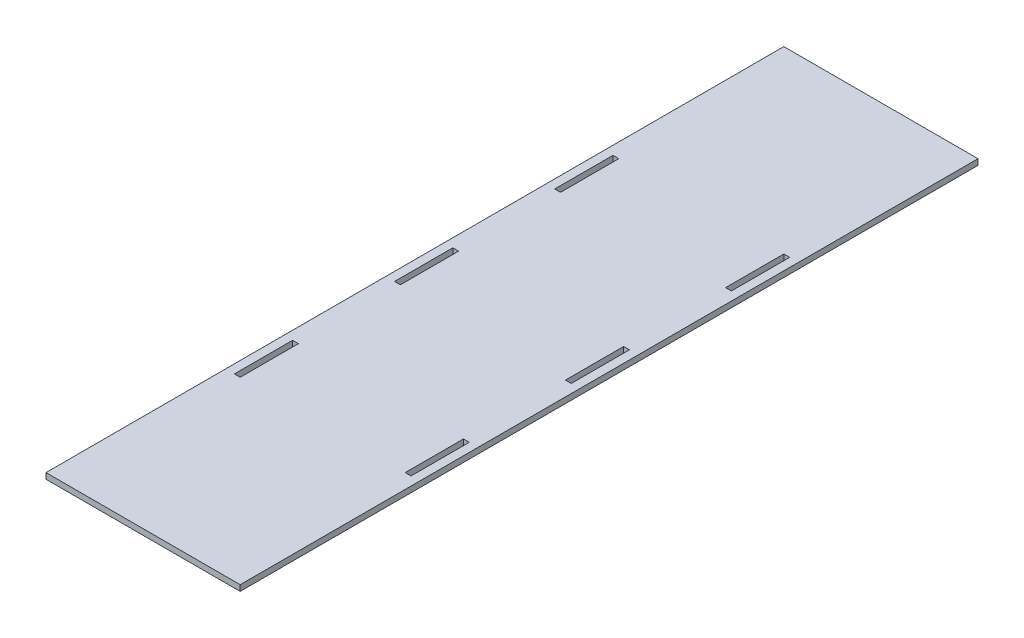
ISO-10303-21;
HEADER;
FILE_DESCRIPTION(('STEP AP214'),'2;1');
FILE_NAME('part.step','',(''),(''),'','','');
FILE_SCHEMA(('AUTOMOTIVE_DESIGN { 1 0 10303 214 1 1 1 1 }'));
ENDSEC;
DATA;
#1=APPLICATION_CONTEXT('core data for automotive mechanical design processes');
#2=APPLICATION_PROTOCOL_DEFINITION('international standard','automotive_design',2000,#1);
#3=PRODUCT_CONTEXT('',#1,'mechanical');
#4=PRODUCT('Part','Part','',(#3));
#5=PRODUCT_RELATED_PRODUCT_CATEGORY('part','',(#4));
#6=PRODUCT_DEFINITION_FORMATION('','',#4);
#7=PRODUCT_DEFINITION_CONTEXT('part definition',#1,'design');
#8=PRODUCT_DEFINITION('design','',#6,#7);
#9=PRODUCT_DEFINITION_SHAPE('','',#8);
#10=(LENGTH_UNIT() NAMED_UNIT(*) SI_UNIT(.MILLI.,.METRE.));
#11=(NAMED_UNIT(*) PLANE_ANGLE_UNIT() SI_UNIT($,.RADIAN.));
#12=(NAMED_UNIT(*) SI_UNIT($,.STERADIAN.) SOLID_ANGLE_UNIT());
#13=UNCERTAINTY_MEASURE_WITH_UNIT(LENGTH_MEASURE(1.E-05),#10,'distance_accuracy_value','');
#14=(GEOMETRIC_REPRESENTATION_CONTEXT(3) GLOBAL_UNCERTAINTY_ASSIGNED_CONTEXT((#13)) GLOBAL_UNIT_ASSIGNED_CONTEXT((#10,
#11,#12)) REPRESENTATION_CONTEXT('',''));
#15=CARTESIAN_POINT('',(0.,0.,0.));
#16=DIRECTION('',(0.,0.,1.));
#17=DIRECTION('',(1.,0.,0.));
#18=AXIS2_PLACEMENT_3D('',#15,#16,#17);
#19=CARTESIAN_POINT('',(0.,3.,0.));
#20=DIRECTION('',(0.,-1.,0.));
#21=DIRECTION('',(0.,0.,-1.));
#22=AXIS2_PLACEMENT_3D('',#19,#20,#21);
#23=PLANE('',#22);
#24=DIRECTION('',(0.,0.,-1.));
#25=VECTOR('',#24,1.);
#26=CARTESIAN_POINT('',(45.5,3.,-15.));
#27=LINE('',#26,#25);
#28=CARTESIAN_POINT('',(45.5,3.,15.));
#29=VERTEX_POINT('',#28);
#30=CARTESIAN_POINT('',(45.5,3.,-15.));
#31=VERTEX_POINT('',#30);
#32=EDGE_CURVE('E259',#29,#31,#27,.T.);
#33=ORIENTED_EDGE('',*,*,#32,.F.);
#34=DIRECTION('',(1.,0.,0.));
#35=VECTOR('',#34,1.);
#36=CARTESIAN_POINT('',(42.5,3.,15.));
#37=LINE('',#36,#35);
#38=CARTESIAN_POINT('',(42.5,3.,15.));
#39=VERTEX_POINT('',#38);
#40=EDGE_CURVE('E267',#39,#29,#37,.T.);
#41=ORIENTED_EDGE('',*,*,#40,.F.);
#42=DIRECTION('',(0.,0.,1.));
#43=VECTOR('',#42,1.);
#44=CARTESIAN_POINT('',(42.5,3.,-15.));
#45=LINE('',#44,#43);
#46=CARTESIAN_POINT('',(42.5,3.,-15.));
#47=VERTEX_POINT('',#46);
#48=EDGE_CURVE('E264',#47,#39,#45,.T.);
#49=ORIENTED_EDGE('',*,*,#48,.F.);
#50=DIRECTION('',(-1.,0.,0.));
#51=VECTOR('',#50,1.);
#52=CARTESIAN_POINT('',(42.5,3.,-15.));
#53=LINE('',#52,#51);
#54=EDGE_CURVE('E261',#31,#47,#53,.T.);
#55=ORIENTED_EDGE('',*,*,#54,.F.);
#56=EDGE_LOOP('',(#33,#41,#49,#55));
#57=FACE_BOUND('',#56,.T.);
#58=DIRECTION('',(0.,0.,-1.));
#59=VECTOR('',#58,1.);
#60=CARTESIAN_POINT('',(-42.5,3.,67.5));
#61=LINE('',#60,#59);
#62=CARTESIAN_POINT('',(-42.5,3.,97.5));
#63=VERTEX_POINT('',#62);
#64=CARTESIAN_POINT('',(-42.5,3.,67.5));
#65=VERTEX_POINT('',#64);
#66=EDGE_CURVE('E321',#63,#65,#61,.T.);
#67=ORIENTED_EDGE('',*,*,#66,.F.);
#68=DIRECTION('',(1.,0.,0.));
#69=VECTOR('',#68,1.);
#70=CARTESIAN_POINT('',(-45.5,3.,97.5));
#71=LINE('',#70,#69);
#72=CARTESIAN_POINT('',(-45.5,3.,97.5));
#73=VERTEX_POINT('',#72);
#74=EDGE_CURVE('E329',#73,#63,#71,.T.);
#75=ORIENTED_EDGE('',*,*,#74,.F.);
#76=DIRECTION('',(0.,0.,1.));
#77=VECTOR('',#76,1.);
#78=CARTESIAN_POINT('',(-45.5,3.,67.5));
#79=LINE('',#78,#77);
#80=CARTESIAN_POINT('',(-45.5,3.,67.5));
#81=VERTEX_POINT('',#80);
#82=EDGE_CURVE('E326',#81,#73,#79,.T.);
#83=ORIENTED_EDGE('',*,*,#82,.F.);
#84=DIRECTION('',(-1.,0.,0.));
#85=VECTOR('',#84,1.);
#86=CARTESIAN_POINT('',(-45.5,3.,67.5));
#87=LINE('',#86,#85);
#88=EDGE_CURVE('E323',#65,#81,#87,.T.);
#89=ORIENTED_EDGE('',*,*,#88,.F.);
#90=EDGE_LOOP('',(#67,#75,#83,#89));
#91=FACE_BOUND('',#90,.T.);
#92=DIRECTION('',(0.,0.,-1.));
#93=VECTOR('',#92,1.);
#94=CARTESIAN_POINT('',(-42.5,3.,-97.4999999999999));
#95=LINE('',#94,#93);
#96=CARTESIAN_POINT('',(-42.5,3.,-67.4999999999999));
#97=VERTEX_POINT('',#96);
#98=CARTESIAN_POINT('',(-42.5,3.,-97.4999999999999));
#99=VERTEX_POINT('',#98);
#100=EDGE_CURVE('E383',#97,#99,#95,.T.);
#101=ORIENTED_EDGE('',*,*,#100,.F.);
#102=DIRECTION('',(1.,0.,0.));
#103=VECTOR('',#102,1.);
#104=CARTESIAN_POINT('',(-45.5,3.,-67.4999999999999));
#105=LINE('',#104,#103);
#106=CARTESIAN_POINT('',(-45.5,3.,-67.4999999999999));
#107=VERTEX_POINT('',#106);
#108=EDGE_CURVE('E391',#107,#97,#105,.T.);
#109=ORIENTED_EDGE('',*,*,#108,.F.);
#110=DIRECTION('',(0.,0.,1.));
#111=VECTOR('',#110,1.);
#112=CARTESIAN_POINT('',(-45.5,3.,-97.4999999999999));
#113=LINE('',#112,#111);
#114=CARTESIAN_POINT('',(-45.5,3.,-97.4999999999999));
#115=VERTEX_POINT('',#114);
#116=EDGE_CURVE('E388',#115,#107,#113,.T.);
#117=ORIENTED_EDGE('',*,*,#116,.F.);
#118=DIRECTION('',(-1.,0.,0.));
#119=VECTOR('',#118,1.);
#120=CARTESIAN_POINT('',(-45.5,3.,-97.4999999999999));
#121=LINE('',#120,#119);
#122=EDGE_CURVE('E385',#99,#115,#121,.T.);
#123=ORIENTED_EDGE('',*,*,#122,.F.);
#124=EDGE_LOOP('',(#101,#109,#117,#123));
#125=FACE_BOUND('',#124,.T.);
#126=DIRECTION('',(0.,0.,-1.));
#127=VECTOR('',#126,1.);
#128=CARTESIAN_POINT('',(50.,3.,190.));
#129=LINE('',#128,#127);
#130=CARTESIAN_POINT('',(50.,3.,190.));
#131=VERTEX_POINT('',#130);
#132=CARTESIAN_POINT('',(50.,3.,-190.));
#133=VERTEX_POINT('',#132);
#134=EDGE_CURVE('E414',#131,#133,#129,.T.);
#135=ORIENTED_EDGE('',*,*,#134,.T.);
#136=DIRECTION('',(-1.,0.,0.));
#137=VECTOR('',#136,1.);
#138=CARTESIAN_POINT('',(-50.,3.,-190.));
#139=LINE('',#138,#137);
#140=CARTESIAN_POINT('',(-50.,3.,-190.));
#141=VERTEX_POINT('',#140);
#142=EDGE_CURVE('E417',#133,#141,#139,.T.);
#143=ORIENTED_EDGE('',*,*,#142,.T.);
#144=DIRECTION('',(0.,0.,1.));
#145=VECTOR('',#144,1.);
#146=CARTESIAN_POINT('',(-50.,3.,190.));
#147=LINE('',#146,#145);
#148=CARTESIAN_POINT('',(-50.,3.,190.));
#149=VERTEX_POINT('',#148);
#150=EDGE_CURVE('E420',#141,#149,#147,.T.);
#151=ORIENTED_EDGE('',*,*,#150,.T.);
#152=DIRECTION('',(1.,0.,0.));
#153=VECTOR('',#152,1.);
#154=CARTESIAN_POINT('',(-50.,3.,190.));
#155=LINE('',#154,#153);
#156=EDGE_CURVE('E422',#149,#131,#155,.T.);
#157=ORIENTED_EDGE('',*,*,#156,.T.);
#158=EDGE_LOOP('',(#135,#143,#151,#157));
#159=FACE_BOUND('',#158,.T.);
#160=DIRECTION('',(0.,0.,-1.));
#161=VECTOR('',#160,1.);
#162=CARTESIAN_POINT('',(-42.5000000000001,3.,-15.));
#163=LINE('',#162,#161);
#164=CARTESIAN_POINT('',(-42.5000000000001,3.,15.));
#165=VERTEX_POINT('',#164);
#166=CARTESIAN_POINT('',(-42.5000000000001,3.,-15.));
#167=VERTEX_POINT('',#166);
#168=EDGE_CURVE('E352',#165,#167,#163,.T.);
#169=ORIENTED_EDGE('',*,*,#168,.F.);
#170=DIRECTION('',(1.,0.,0.));
#171=VECTOR('',#170,1.);
#172=CARTESIAN_POINT('',(-45.5000000000001,3.,15.));
#173=LINE('',#172,#171);
#174=CARTESIAN_POINT('',(-45.5000000000001,3.,15.));
#175=VERTEX_POINT('',#174);
#176=EDGE_CURVE('E360',#175,#165,#173,.T.);
#177=ORIENTED_EDGE('',*,*,#176,.F.);
#178=DIRECTION('',(0.,0.,1.));
#179=VECTOR('',#178,1.);
#180=CARTESIAN_POINT('',(-45.5000000000001,3.,-15.));
#181=LINE('',#180,#179);
#182=CARTESIAN_POINT('',(-45.5000000000001,3.,-15.));
#183=VERTEX_POINT('',#182);
#184=EDGE_CURVE('E357',#183,#175,#181,.T.);
#185=ORIENTED_EDGE('',*,*,#184,.F.);
#186=DIRECTION('',(-1.,0.,0.));
#187=VECTOR('',#186,1.);
#188=CARTESIAN_POINT('',(-45.5000000000001,3.,-15.));
#189=LINE('',#188,#187);
#190=EDGE_CURVE('E354',#167,#183,#189,.T.);
#191=ORIENTED_EDGE('',*,*,#190,.F.);
#192=EDGE_LOOP('',(#169,#177,#185,#191));
#193=FACE_BOUND('',#192,.T.);
#194=DIRECTION('',(0.,0.,-1.));
#195=VECTOR('',#194,1.);
#196=CARTESIAN_POINT('',(45.5,3.,-97.5));
#197=LINE('',#196,#195);
#198=CARTESIAN_POINT('',(45.5,3.,-67.5));
#199=VERTEX_POINT('',#198);
#200=CARTESIAN_POINT('',(45.5,3.,-97.5));
#201=VERTEX_POINT('',#200);
#202=EDGE_CURVE('E290',#199,#201,#197,.T.);
#203=ORIENTED_EDGE('',*,*,#202,.F.);
#204=DIRECTION('',(1.,0.,0.));
#205=VECTOR('',#204,1.);
#206=CARTESIAN_POINT('',(42.5,3.,-67.5));
#207=LINE('',#206,#205);
#208=CARTESIAN_POINT('',(42.5,3.,-67.5));
#209=VERTEX_POINT('',#208);
#210=EDGE_CURVE('E298',#209,#199,#207,.T.);
#211=ORIENTED_EDGE('',*,*,#210,.F.);
#212=DIRECTION('',(0.,0.,1.));
#213=VECTOR('',#212,1.);
#214=CARTESIAN_POINT('',(42.5,3.,-97.5));
#215=LINE('',#214,#213);
#216=CARTESIAN_POINT('',(42.5,3.,-97.5));
#217=VERTEX_POINT('',#216);
#218=EDGE_CURVE('E295',#217,#209,#215,.T.);
#219=ORIENTED_EDGE('',*,*,#218,.F.);
#220=DIRECTION('',(-1.,0.,0.));
#221=VECTOR('',#220,1.);
#222=CARTESIAN_POINT('',(42.5,3.,-97.5));
#223=LINE('',#222,#221);
#224=EDGE_CURVE('E292',#201,#217,#223,.T.);
#225=ORIENTED_EDGE('',*,*,#224,.F.);
#226=EDGE_LOOP('',(#203,#211,#219,#225));
#227=FACE_BOUND('',#226,.T.);
#228=DIRECTION('',(0.,0.,-1.));
#229=VECTOR('',#228,1.);
#230=CARTESIAN_POINT('',(45.5,3.,67.5));
#231=LINE('',#230,#229);
#232=CARTESIAN_POINT('',(45.5,3.,97.5));
#233=VERTEX_POINT('',#232);
#234=CARTESIAN_POINT('',(45.5,3.,67.5));
#235=VERTEX_POINT('',#234);
#236=EDGE_CURVE('E223',#233,#235,#231,.T.);
#237=ORIENTED_EDGE('',*,*,#236,.F.);
#238=DIRECTION('',(1.,0.,0.));
#239=VECTOR('',#238,1.);
#240=CARTESIAN_POINT('',(42.5,3.,97.5));
#241=LINE('',#240,#239);
#242=CARTESIAN_POINT('',(42.5,3.,97.5));
#243=VERTEX_POINT('',#242);
#244=EDGE_CURVE('E245',#243,#233,#241,.T.);
#245=ORIENTED_EDGE('',*,*,#244,.F.);
#246=DIRECTION('',(0.,0.,1.));
#247=VECTOR('',#246,1.);
#248=CARTESIAN_POINT('',(42.5,3.,67.5));
#249=LINE('',#248,#247);
#250=CARTESIAN_POINT('',(42.5,3.,67.5));
#251=VERTEX_POINT('',#250);
#252=EDGE_CURVE('E243',#251,#243,#249,.T.);
#253=ORIENTED_EDGE('',*,*,#252,.F.);
#254=DIRECTION('',(-1.,0.,0.));
#255=VECTOR('',#254,1.);
#256=CARTESIAN_POINT('',(42.5,3.,67.5));
#257=LINE('',#256,#255);
#258=EDGE_CURVE('E231',#235,#251,#257,.T.);
#259=ORIENTED_EDGE('',*,*,#258,.F.);
#260=EDGE_LOOP('',(#237,#245,#253,#259));
#261=FACE_BOUND('',#260,.T.);
#262=ADVANCED_FACE('F38',(#57,#91,#125,#159,#193,#227,#261),#23,.F.);
#263=CARTESIAN_POINT('',(0.,0.,0.));
#264=DIRECTION('',(0.,-1.,0.));
#265=DIRECTION('',(0.,0.,-1.));
#266=AXIS2_PLACEMENT_3D('',#263,#264,#265);
#267=PLANE('',#266);
#268=DIRECTION('',(0.,0.,-1.));
#269=VECTOR('',#268,1.);
#270=CARTESIAN_POINT('',(50.,0.,190.));
#271=LINE('',#270,#269);
#272=CARTESIAN_POINT('',(50.,0.,190.));
#273=VERTEX_POINT('',#272);
#274=CARTESIAN_POINT('',(50.,0.,-190.));
#275=VERTEX_POINT('',#274);
#276=EDGE_CURVE('E413',#273,#275,#271,.T.);
#277=ORIENTED_EDGE('',*,*,#276,.F.);
#278=DIRECTION('',(1.,0.,0.));
#279=VECTOR('',#278,1.);
#280=CARTESIAN_POINT('',(-50.,0.,190.));
#281=LINE('',#280,#279);
#282=CARTESIAN_POINT('',(-50.,0.,190.));
#283=VERTEX_POINT('',#282);
#284=EDGE_CURVE('E418',#283,#273,#281,.T.);
#285=ORIENTED_EDGE('',*,*,#284,.F.);
#286=DIRECTION('',(0.,0.,1.));
#287=VECTOR('',#286,1.);
#288=CARTESIAN_POINT('',(-50.,0.,190.));
#289=LINE('',#288,#287);
#290=CARTESIAN_POINT('',(-50.,0.,-190.));
#291=VERTEX_POINT('',#290);
#292=EDGE_CURVE('E429',#291,#283,#289,.T.);
#293=ORIENTED_EDGE('',*,*,#292,.F.);
#294=DIRECTION('',(-1.,0.,0.));
#295=VECTOR('',#294,1.);
#296=CARTESIAN_POINT('',(-50.,0.,-190.));
#297=LINE('',#296,#295);
#298=EDGE_CURVE('E427',#275,#291,#297,.T.);
#299=ORIENTED_EDGE('',*,*,#298,.F.);
#300=EDGE_LOOP('',(#277,#285,#293,#299));
#301=FACE_BOUND('',#300,.T.);
#302=DIRECTION('',(1.,0.,0.));
#303=VECTOR('',#302,1.);
#304=CARTESIAN_POINT('',(-45.5,0.,-67.4999999999999));
#305=LINE('',#304,#303);
#306=CARTESIAN_POINT('',(-45.5,0.,-67.4999999999999));
#307=VERTEX_POINT('',#306);
#308=CARTESIAN_POINT('',(-42.5,0.,-67.4999999999999));
#309=VERTEX_POINT('',#308);
#310=EDGE_CURVE('E386',#307,#309,#305,.T.);
#311=ORIENTED_EDGE('',*,*,#310,.T.);
#312=DIRECTION('',(0.,0.,-1.));
#313=VECTOR('',#312,1.);
#314=CARTESIAN_POINT('',(-42.5,0.,-97.4999999999999));
#315=LINE('',#314,#313);
#316=CARTESIAN_POINT('',(-42.5,0.,-97.4999999999999));
#317=VERTEX_POINT('',#316);
#318=EDGE_CURVE('E382',#309,#317,#315,.T.);
#319=ORIENTED_EDGE('',*,*,#318,.T.);
#320=DIRECTION('',(-1.,0.,0.));
#321=VECTOR('',#320,1.);
#322=CARTESIAN_POINT('',(-45.5,0.,-97.4999999999999));
#323=LINE('',#322,#321);
#324=CARTESIAN_POINT('',(-45.5,0.,-97.4999999999999));
#325=VERTEX_POINT('',#324);
#326=EDGE_CURVE('E396',#317,#325,#323,.T.);
#327=ORIENTED_EDGE('',*,*,#326,.T.);
#328=DIRECTION('',(0.,0.,1.));
#329=VECTOR('',#328,1.);
#330=CARTESIAN_POINT('',(-45.5,0.,-97.4999999999999));
#331=LINE('',#330,#329);
#332=EDGE_CURVE('E399',#325,#307,#331,.T.);
#333=ORIENTED_EDGE('',*,*,#332,.T.);
#334=EDGE_LOOP('',(#311,#319,#327,#333));
#335=FACE_BOUND('',#334,.T.);
#336=DIRECTION('',(1.,0.,0.));
#337=VECTOR('',#336,1.);
#338=CARTESIAN_POINT('',(-45.5000000000001,0.,15.));
#339=LINE('',#338,#337);
#340=CARTESIAN_POINT('',(-45.5000000000001,0.,15.));
#341=VERTEX_POINT('',#340);
#342=CARTESIAN_POINT('',(-42.5000000000001,0.,15.));
#343=VERTEX_POINT('',#342);
#344=EDGE_CURVE('E355',#341,#343,#339,.T.);
#345=ORIENTED_EDGE('',*,*,#344,.T.);
#346=DIRECTION('',(0.,0.,-1.));
#347=VECTOR('',#346,1.);
#348=CARTESIAN_POINT('',(-42.5000000000001,0.,-15.));
#349=LINE('',#348,#347);
#350=CARTESIAN_POINT('',(-42.5000000000001,0.,-15.));
#351=VERTEX_POINT('',#350);
#352=EDGE_CURVE('E351',#343,#351,#349,.T.);
#353=ORIENTED_EDGE('',*,*,#352,.T.);
#354=DIRECTION('',(-1.,0.,0.));
#355=VECTOR('',#354,1.);
#356=CARTESIAN_POINT('',(-45.5000000000001,0.,-15.));
#357=LINE('',#356,#355);
#358=CARTESIAN_POINT('',(-45.5000000000001,0.,-15.));
#359=VERTEX_POINT('',#358);
#360=EDGE_CURVE('E365',#351,#359,#357,.T.);
#361=ORIENTED_EDGE('',*,*,#360,.T.);
#362=DIRECTION('',(0.,0.,1.));
#363=VECTOR('',#362,1.);
#364=CARTESIAN_POINT('',(-45.5000000000001,0.,-15.));
#365=LINE('',#364,#363);
#366=EDGE_CURVE('E368',#359,#341,#365,.T.);
#367=ORIENTED_EDGE('',*,*,#366,.T.);
#368=EDGE_LOOP('',(#345,#353,#361,#367));
#369=FACE_BOUND('',#368,.T.);
#370=DIRECTION('',(1.,0.,0.));
#371=VECTOR('',#370,1.);
#372=CARTESIAN_POINT('',(-45.5,0.,97.5));
#373=LINE('',#372,#371);
#374=CARTESIAN_POINT('',(-45.5,0.,97.5));
#375=VERTEX_POINT('',#374);
#376=CARTESIAN_POINT('',(-42.5,0.,97.5));
#377=VERTEX_POINT('',#376);
#378=EDGE_CURVE('E324',#375,#377,#373,.T.);
#379=ORIENTED_EDGE('',*,*,#378,.T.);
#380=DIRECTION('',(0.,0.,-1.));
#381=VECTOR('',#380,1.);
#382=CARTESIAN_POINT('',(-42.5,0.,67.5));
#383=LINE('',#382,#381);
#384=CARTESIAN_POINT('',(-42.5,0.,67.5));
#385=VERTEX_POINT('',#384);
#386=EDGE_CURVE('E320',#377,#385,#383,.T.);
#387=ORIENTED_EDGE('',*,*,#386,.T.);
#388=DIRECTION('',(-1.,0.,0.));
#389=VECTOR('',#388,1.);
#390=CARTESIAN_POINT('',(-45.5,0.,67.5));
#391=LINE('',#390,#389);
#392=CARTESIAN_POINT('',(-45.5,0.,67.5));
#393=VERTEX_POINT('',#392);
#394=EDGE_CURVE('E334',#385,#393,#391,.T.);
#395=ORIENTED_EDGE('',*,*,#394,.T.);
#396=DIRECTION('',(0.,0.,1.));
#397=VECTOR('',#396,1.);
#398=CARTESIAN_POINT('',(-45.5,0.,67.5));
#399=LINE('',#398,#397);
#400=EDGE_CURVE('E337',#393,#375,#399,.T.);
#401=ORIENTED_EDGE('',*,*,#400,.T.);
#402=EDGE_LOOP('',(#379,#387,#395,#401));
#403=FACE_BOUND('',#402,.T.);
#404=DIRECTION('',(1.,0.,0.));
#405=VECTOR('',#404,1.);
#406=CARTESIAN_POINT('',(42.5,0.,-67.5));
#407=LINE('',#406,#405);
#408=CARTESIAN_POINT('',(42.5,0.,-67.5));
#409=VERTEX_POINT('',#408);
#410=CARTESIAN_POINT('',(45.5,0.,-67.5));
#411=VERTEX_POINT('',#410);
#412=EDGE_CURVE('E293',#409,#411,#407,.T.);
#413=ORIENTED_EDGE('',*,*,#412,.T.);
#414=DIRECTION('',(0.,0.,-1.));
#415=VECTOR('',#414,1.);
#416=CARTESIAN_POINT('',(45.5,0.,-97.5));
#417=LINE('',#416,#415);
#418=CARTESIAN_POINT('',(45.5,0.,-97.5));
#419=VERTEX_POINT('',#418);
#420=EDGE_CURVE('E289',#411,#419,#417,.T.);
#421=ORIENTED_EDGE('',*,*,#420,.T.);
#422=DIRECTION('',(-1.,0.,0.));
#423=VECTOR('',#422,1.);
#424=CARTESIAN_POINT('',(42.5,0.,-97.5));
#425=LINE('',#424,#423);
#426=CARTESIAN_POINT('',(42.5,0.,-97.5));
#427=VERTEX_POINT('',#426);
#428=EDGE_CURVE('E303',#419,#427,#425,.T.);
#429=ORIENTED_EDGE('',*,*,#428,.T.);
#430=DIRECTION('',(0.,0.,1.));
#431=VECTOR('',#430,1.);
#432=CARTESIAN_POINT('',(42.5,0.,-97.5));
#433=LINE('',#432,#431);
#434=EDGE_CURVE('E306',#427,#409,#433,.T.);
#435=ORIENTED_EDGE('',*,*,#434,.T.);
#436=EDGE_LOOP('',(#413,#421,#429,#435));
#437=FACE_BOUND('',#436,.T.);
#438=DIRECTION('',(1.,0.,0.));
#439=VECTOR('',#438,1.);
#440=CARTESIAN_POINT('',(42.5,0.,15.));
#441=LINE('',#440,#439);
#442=CARTESIAN_POINT('',(42.5,0.,15.));
#443=VERTEX_POINT('',#442);
#444=CARTESIAN_POINT('',(45.5,0.,15.));
#445=VERTEX_POINT('',#444);
#446=EDGE_CURVE('E262',#443,#445,#441,.T.);
#447=ORIENTED_EDGE('',*,*,#446,.T.);
#448=DIRECTION('',(0.,0.,-1.));
#449=VECTOR('',#448,1.);
#450=CARTESIAN_POINT('',(45.5,0.,-15.));
#451=LINE('',#450,#449);
#452=CARTESIAN_POINT('',(45.5,0.,-15.));
#453=VERTEX_POINT('',#452);
#454=EDGE_CURVE('E239',#445,#453,#451,.T.);
#455=ORIENTED_EDGE('',*,*,#454,.T.);
#456=DIRECTION('',(-1.,0.,0.));
#457=VECTOR('',#456,1.);
#458=CARTESIAN_POINT('',(42.5,0.,-15.));
#459=LINE('',#458,#457);
#460=CARTESIAN_POINT('',(42.5,0.,-15.));
#461=VERTEX_POINT('',#460);
#462=EDGE_CURVE('E272',#453,#461,#459,.T.);
#463=ORIENTED_EDGE('',*,*,#462,.T.);
#464=DIRECTION('',(0.,0.,1.));
#465=VECTOR('',#464,1.);
#466=CARTESIAN_POINT('',(42.5,0.,-15.));
#467=LINE('',#466,#465);
#468=EDGE_CURVE('E275',#461,#443,#467,.T.);
#469=ORIENTED_EDGE('',*,*,#468,.T.);
#470=EDGE_LOOP('',(#447,#455,#463,#469));
#471=FACE_BOUND('',#470,.T.);
#472=DIRECTION('',(1.,0.,0.));
#473=VECTOR('',#472,1.);
#474=CARTESIAN_POINT('',(42.5,0.,97.5));
#475=LINE('',#474,#473);
#476=CARTESIAN_POINT('',(42.5,0.,97.5));
#477=VERTEX_POINT('',#476);
#478=CARTESIAN_POINT('',(45.5,0.,97.5));
#479=VERTEX_POINT('',#478);
#480=EDGE_CURVE('E232',#477,#479,#475,.T.);
#481=ORIENTED_EDGE('',*,*,#480,.T.);
#482=DIRECTION('',(0.,0.,-1.));
#483=VECTOR('',#482,1.);
#484=CARTESIAN_POINT('',(45.5,0.,67.5));
#485=LINE('',#484,#483);
#486=CARTESIAN_POINT('',(45.5,0.,67.5));
#487=VERTEX_POINT('',#486);
#488=EDGE_CURVE('E61',#479,#487,#485,.T.);
#489=ORIENTED_EDGE('',*,*,#488,.T.);
#490=DIRECTION('',(-1.,0.,0.));
#491=VECTOR('',#490,1.);
#492=CARTESIAN_POINT('',(42.5,0.,67.5));
#493=LINE('',#492,#491);
#494=CARTESIAN_POINT('',(42.5,0.,67.5));
#495=VERTEX_POINT('',#494);
#496=EDGE_CURVE('E238',#487,#495,#493,.T.);
#497=ORIENTED_EDGE('',*,*,#496,.T.);
#498=DIRECTION('',(0.,0.,1.));
#499=VECTOR('',#498,1.);
#500=CARTESIAN_POINT('',(42.5,0.,67.5));
#501=LINE('',#500,#499);
#502=EDGE_CURVE('E251',#495,#477,#501,.T.);
#503=ORIENTED_EDGE('',*,*,#502,.T.);
#504=EDGE_LOOP('',(#481,#489,#497,#503));
#505=FACE_BOUND('',#504,.T.);
#506=ADVANCED_FACE('F447',(#301,#335,#369,#403,#437,#471,#505),#267,.T.);
#507=CARTESIAN_POINT('',(50.,3.,190.));
#508=DIRECTION('',(-1.,0.,0.));
#509=DIRECTION('',(0.,0.,1.));
#510=AXIS2_PLACEMENT_3D('',#507,#508,#509);
#511=PLANE('',#510);
#512=ORIENTED_EDGE('',*,*,#276,.T.);
#513=DIRECTION('',(0.,-1.,0.));
#514=VECTOR('',#513,1.);
#515=CARTESIAN_POINT('',(50.,3.,-190.));
#516=LINE('',#515,#514);
#517=EDGE_CURVE('E11',#133,#275,#516,.T.);
#518=ORIENTED_EDGE('',*,*,#517,.F.);
#519=ORIENTED_EDGE('',*,*,#134,.F.);
#520=DIRECTION('',(0.,-1.,0.));
#521=VECTOR('',#520,1.);
#522=CARTESIAN_POINT('',(50.,3.,190.));
#523=LINE('',#522,#521);
#524=EDGE_CURVE('E424',#131,#273,#523,.T.);
#525=ORIENTED_EDGE('',*,*,#524,.T.);
#526=EDGE_LOOP('',(#512,#518,#519,#525));
#527=FACE_BOUND('',#526,.T.);
#528=ADVANCED_FACE('F40',(#527),#511,.F.);
#529=CARTESIAN_POINT('',(-50.,3.,-190.));
#530=DIRECTION('',(0.,0.,1.));
#531=DIRECTION('',(1.,0.,0.));
#532=AXIS2_PLACEMENT_3D('',#529,#530,#531);
#533=PLANE('',#532);
#534=ORIENTED_EDGE('',*,*,#298,.T.);
#535=DIRECTION('',(0.,-1.,0.));
#536=VECTOR('',#535,1.);
#537=CARTESIAN_POINT('',(-50.,3.,-190.));
#538=LINE('',#537,#536);
#539=EDGE_CURVE('E46',#141,#291,#538,.T.);
#540=ORIENTED_EDGE('',*,*,#539,.F.);
#541=ORIENTED_EDGE('',*,*,#142,.F.);
#542=ORIENTED_EDGE('',*,*,#517,.T.);
#543=EDGE_LOOP('',(#534,#540,#541,#542));
#544=FACE_BOUND('',#543,.T.);
#545=ADVANCED_FACE('F458',(#544),#533,.F.);
#546=CARTESIAN_POINT('',(-50.,3.,190.));
#547=DIRECTION('',(1.,0.,0.));
#548=DIRECTION('',(0.,0.,-1.));
#549=AXIS2_PLACEMENT_3D('',#546,#547,#548);
#550=PLANE('',#549);
#551=ORIENTED_EDGE('',*,*,#292,.T.);
#552=DIRECTION('',(0.,-1.,0.));
#553=VECTOR('',#552,1.);
#554=CARTESIAN_POINT('',(-50.,3.,190.));
#555=LINE('',#554,#553);
#556=EDGE_CURVE('E434',#149,#283,#555,.T.);
#557=ORIENTED_EDGE('',*,*,#556,.F.);
#558=ORIENTED_EDGE('',*,*,#150,.F.);
#559=ORIENTED_EDGE('',*,*,#539,.T.);
#560=EDGE_LOOP('',(#551,#557,#558,#559));
#561=FACE_BOUND('',#560,.T.);
#562=ADVANCED_FACE('F441',(#561),#550,.F.);
#563=CARTESIAN_POINT('',(-50.,3.,190.));
#564=DIRECTION('',(0.,0.,-1.));
#565=DIRECTION('',(-1.,0.,0.));
#566=AXIS2_PLACEMENT_3D('',#563,#564,#565);
#567=PLANE('',#566);
#568=ORIENTED_EDGE('',*,*,#284,.T.);
#569=ORIENTED_EDGE('',*,*,#524,.F.);
#570=ORIENTED_EDGE('',*,*,#156,.F.);
#571=ORIENTED_EDGE('',*,*,#556,.T.);
#572=EDGE_LOOP('',(#568,#569,#570,#571));
#573=FACE_BOUND('',#572,.T.);
#574=ADVANCED_FACE('F451',(#573),#567,.F.);
#575=CARTESIAN_POINT('',(-42.5,3.,-97.4999999999999));
#576=DIRECTION('',(-1.,0.,0.));
#577=DIRECTION('',(0.,0.,1.));
#578=AXIS2_PLACEMENT_3D('',#575,#576,#577);
#579=PLANE('',#578);
#580=ORIENTED_EDGE('',*,*,#318,.F.);
#581=DIRECTION('',(0.,-1.,0.));
#582=VECTOR('',#581,1.);
#583=CARTESIAN_POINT('',(-42.5,3.,-67.4999999999999));
#584=LINE('',#583,#582);
#585=EDGE_CURVE('E393',#97,#309,#584,.T.);
#586=ORIENTED_EDGE('',*,*,#585,.F.);
#587=ORIENTED_EDGE('',*,*,#100,.T.);
#588=DIRECTION('',(0.,-1.,0.));
#589=VECTOR('',#588,1.);
#590=CARTESIAN_POINT('',(-42.5,3.,-97.4999999999999));
#591=LINE('',#590,#589);
#592=EDGE_CURVE('E410',#99,#317,#591,.T.);
#593=ORIENTED_EDGE('',*,*,#592,.T.);
#594=EDGE_LOOP('',(#580,#586,#587,#593));
#595=FACE_BOUND('',#594,.T.);
#596=ADVANCED_FACE('F475',(#595),#579,.T.);
#597=CARTESIAN_POINT('',(-45.5,3.,-97.4999999999999));
#598=DIRECTION('',(0.,0.,1.));
#599=DIRECTION('',(1.,0.,0.));
#600=AXIS2_PLACEMENT_3D('',#597,#598,#599);
#601=PLANE('',#600);
#602=ORIENTED_EDGE('',*,*,#326,.F.);
#603=ORIENTED_EDGE('',*,*,#592,.F.);
#604=ORIENTED_EDGE('',*,*,#122,.T.);
#605=DIRECTION('',(0.,-1.,0.));
#606=VECTOR('',#605,1.);
#607=CARTESIAN_POINT('',(-45.5,3.,-97.4999999999999));
#608=LINE('',#607,#606);
#609=EDGE_CURVE('E408',#115,#325,#608,.T.);
#610=ORIENTED_EDGE('',*,*,#609,.T.);
#611=EDGE_LOOP('',(#602,#603,#604,#610));
#612=FACE_BOUND('',#611,.T.);
#613=ADVANCED_FACE('F482',(#612),#601,.T.);
#614=CARTESIAN_POINT('',(-45.5,3.,-97.4999999999999));
#615=DIRECTION('',(1.,0.,0.));
#616=DIRECTION('',(0.,0.,-1.));
#617=AXIS2_PLACEMENT_3D('',#614,#615,#616);
#618=PLANE('',#617);
#619=ORIENTED_EDGE('',*,*,#332,.F.);
#620=ORIENTED_EDGE('',*,*,#609,.F.);
#621=ORIENTED_EDGE('',*,*,#116,.T.);
#622=DIRECTION('',(0.,-1.,0.));
#623=VECTOR('',#622,1.);
#624=CARTESIAN_POINT('',(-45.5,3.,-67.4999999999999));
#625=LINE('',#624,#623);
#626=EDGE_CURVE('E406',#107,#307,#625,.T.);
#627=ORIENTED_EDGE('',*,*,#626,.T.);
#628=EDGE_LOOP('',(#619,#620,#621,#627));
#629=FACE_BOUND('',#628,.T.);
#630=ADVANCED_FACE('F487',(#629),#618,.T.);
#631=CARTESIAN_POINT('',(-45.5,3.,-67.4999999999999));
#632=DIRECTION('',(0.,0.,-1.));
#633=DIRECTION('',(-1.,0.,0.));
#634=AXIS2_PLACEMENT_3D('',#631,#632,#633);
#635=PLANE('',#634);
#636=ORIENTED_EDGE('',*,*,#310,.F.);
#637=ORIENTED_EDGE('',*,*,#626,.F.);
#638=ORIENTED_EDGE('',*,*,#108,.T.);
#639=ORIENTED_EDGE('',*,*,#585,.T.);
#640=EDGE_LOOP('',(#636,#637,#638,#639));
#641=FACE_BOUND('',#640,.T.);
#642=ADVANCED_FACE('F494',(#641),#635,.T.);
#643=CARTESIAN_POINT('',(-42.5000000000001,3.,-15.));
#644=DIRECTION('',(-1.,0.,0.));
#645=DIRECTION('',(0.,0.,1.));
#646=AXIS2_PLACEMENT_3D('',#643,#644,#645);
#647=PLANE('',#646);
#648=ORIENTED_EDGE('',*,*,#352,.F.);
#649=DIRECTION('',(0.,-1.,0.));
#650=VECTOR('',#649,1.);
#651=CARTESIAN_POINT('',(-42.5000000000001,3.,15.));
#652=LINE('',#651,#650);
#653=EDGE_CURVE('E362',#165,#343,#652,.T.);
#654=ORIENTED_EDGE('',*,*,#653,.F.);
#655=ORIENTED_EDGE('',*,*,#168,.T.);
#656=DIRECTION('',(0.,-1.,0.));
#657=VECTOR('',#656,1.);
#658=CARTESIAN_POINT('',(-42.5000000000001,3.,-15.));
#659=LINE('',#658,#657);
#660=EDGE_CURVE('E379',#167,#351,#659,.T.);
#661=ORIENTED_EDGE('',*,*,#660,.T.);
#662=EDGE_LOOP('',(#648,#654,#655,#661));
#663=FACE_BOUND('',#662,.T.);
#664=ADVANCED_FACE('F508',(#663),#647,.T.);
#665=CARTESIAN_POINT('',(-45.5000000000001,3.,-15.));
#666=DIRECTION('',(0.,0.,1.));
#667=DIRECTION('',(1.,0.,0.));
#668=AXIS2_PLACEMENT_3D('',#665,#666,#667);
#669=PLANE('',#668);
#670=ORIENTED_EDGE('',*,*,#360,.F.);
#671=ORIENTED_EDGE('',*,*,#660,.F.);
#672=ORIENTED_EDGE('',*,*,#190,.T.);
#673=DIRECTION('',(0.,-1.,0.));
#674=VECTOR('',#673,1.);
#675=CARTESIAN_POINT('',(-45.5000000000001,3.,-15.));
#676=LINE('',#675,#674);
#677=EDGE_CURVE('E377',#183,#359,#676,.T.);
#678=ORIENTED_EDGE('',*,*,#677,.T.);
#679=EDGE_LOOP('',(#670,#671,#672,#678));
#680=FACE_BOUND('',#679,.T.);
#681=ADVANCED_FACE('F513',(#680),#669,.T.);
#682=CARTESIAN_POINT('',(-45.5000000000001,3.,-15.));
#683=DIRECTION('',(1.,0.,0.));
#684=DIRECTION('',(0.,0.,-1.));
#685=AXIS2_PLACEMENT_3D('',#682,#683,#684);
#686=PLANE('',#685);
#687=ORIENTED_EDGE('',*,*,#366,.F.);
#688=ORIENTED_EDGE('',*,*,#677,.F.);
#689=ORIENTED_EDGE('',*,*,#184,.T.);
#690=DIRECTION('',(0.,-1.,0.));
#691=VECTOR('',#690,1.);
#692=CARTESIAN_POINT('',(-45.5000000000001,3.,15.));
#693=LINE('',#692,#691);
#694=EDGE_CURVE('E375',#175,#341,#693,.T.);
#695=ORIENTED_EDGE('',*,*,#694,.T.);
#696=EDGE_LOOP('',(#687,#688,#689,#695));
#697=FACE_BOUND('',#696,.T.);
#698=ADVANCED_FACE('F517',(#697),#686,.T.);
#699=CARTESIAN_POINT('',(-45.5000000000001,3.,15.));
#700=DIRECTION('',(0.,0.,-1.));
#701=DIRECTION('',(-1.,0.,0.));
#702=AXIS2_PLACEMENT_3D('',#699,#700,#701);
#703=PLANE('',#702);
#704=ORIENTED_EDGE('',*,*,#344,.F.);
#705=ORIENTED_EDGE('',*,*,#694,.F.);
#706=ORIENTED_EDGE('',*,*,#176,.T.);
#707=ORIENTED_EDGE('',*,*,#653,.T.);
#708=EDGE_LOOP('',(#704,#705,#706,#707));
#709=FACE_BOUND('',#708,.T.);
#710=ADVANCED_FACE('F521',(#709),#703,.T.);
#711=CARTESIAN_POINT('',(-42.5,3.,67.5));
#712=DIRECTION('',(-1.,0.,0.));
#713=DIRECTION('',(0.,0.,1.));
#714=AXIS2_PLACEMENT_3D('',#711,#712,#713);
#715=PLANE('',#714);
#716=ORIENTED_EDGE('',*,*,#386,.F.);
#717=DIRECTION('',(0.,-1.,0.));
#718=VECTOR('',#717,1.);
#719=CARTESIAN_POINT('',(-42.5,3.,97.5));
#720=LINE('',#719,#718);
#721=EDGE_CURVE('E331',#63,#377,#720,.T.);
#722=ORIENTED_EDGE('',*,*,#721,.F.);
#723=ORIENTED_EDGE('',*,*,#66,.T.);
#724=DIRECTION('',(0.,-1.,0.));
#725=VECTOR('',#724,1.);
#726=CARTESIAN_POINT('',(-42.5,3.,67.5));
#727=LINE('',#726,#725);
#728=EDGE_CURVE('E348',#65,#385,#727,.T.);
#729=ORIENTED_EDGE('',*,*,#728,.T.);
#730=EDGE_LOOP('',(#716,#722,#723,#729));
#731=FACE_BOUND('',#730,.T.);
#732=ADVANCED_FACE('F525',(#731),#715,.T.);
#733=CARTESIAN_POINT('',(-45.5,3.,67.5));
#734=DIRECTION('',(0.,0.,1.));
#735=DIRECTION('',(1.,0.,0.));
#736=AXIS2_PLACEMENT_3D('',#733,#734,#735);
#737=PLANE('',#736);
#738=ORIENTED_EDGE('',*,*,#394,.F.);
#739=ORIENTED_EDGE('',*,*,#728,.F.);
#740=ORIENTED_EDGE('',*,*,#88,.T.);
#741=DIRECTION('',(0.,-1.,0.));
#742=VECTOR('',#741,1.);
#743=CARTESIAN_POINT('',(-45.5,3.,67.5));
#744=LINE('',#743,#742);
#745=EDGE_CURVE('E346',#81,#393,#744,.T.);
#746=ORIENTED_EDGE('',*,*,#745,.T.);
#747=EDGE_LOOP('',(#738,#739,#740,#746));
#748=FACE_BOUND('',#747,.T.);
#749=ADVANCED_FACE('F529',(#748),#737,.T.);
#750=CARTESIAN_POINT('',(-45.5,3.,67.5));
#751=DIRECTION('',(1.,0.,0.));
#752=DIRECTION('',(0.,0.,-1.));
#753=AXIS2_PLACEMENT_3D('',#750,#751,#752);
#754=PLANE('',#753);
#755=ORIENTED_EDGE('',*,*,#400,.F.);
#756=ORIENTED_EDGE('',*,*,#745,.F.);
#757=ORIENTED_EDGE('',*,*,#82,.T.);
#758=DIRECTION('',(0.,-1.,0.));
#759=VECTOR('',#758,1.);
#760=CARTESIAN_POINT('',(-45.5,3.,97.5));
#761=LINE('',#760,#759);
#762=EDGE_CURVE('E344',#73,#375,#761,.T.);
#763=ORIENTED_EDGE('',*,*,#762,.T.);
#764=EDGE_LOOP('',(#755,#756,#757,#763));
#765=FACE_BOUND('',#764,.T.);
#766=ADVANCED_FACE('F533',(#765),#754,.T.);
#767=CARTESIAN_POINT('',(-45.5,3.,97.5));
#768=DIRECTION('',(0.,0.,-1.));
#769=DIRECTION('',(-1.,0.,0.));
#770=AXIS2_PLACEMENT_3D('',#767,#768,#769);
#771=PLANE('',#770);
#772=ORIENTED_EDGE('',*,*,#378,.F.);
#773=ORIENTED_EDGE('',*,*,#762,.F.);
#774=ORIENTED_EDGE('',*,*,#74,.T.);
#775=ORIENTED_EDGE('',*,*,#721,.T.);
#776=EDGE_LOOP('',(#772,#773,#774,#775));
#777=FACE_BOUND('',#776,.T.);
#778=ADVANCED_FACE('F537',(#777),#771,.T.);
#779=CARTESIAN_POINT('',(45.5,3.,-97.5));
#780=DIRECTION('',(-1.,0.,0.));
#781=DIRECTION('',(0.,0.,1.));
#782=AXIS2_PLACEMENT_3D('',#779,#780,#781);
#783=PLANE('',#782);
#784=ORIENTED_EDGE('',*,*,#420,.F.);
#785=DIRECTION('',(0.,-1.,0.));
#786=VECTOR('',#785,1.);
#787=CARTESIAN_POINT('',(45.5,3.,-67.5));
#788=LINE('',#787,#786);
#789=EDGE_CURVE('E300',#199,#411,#788,.T.);
#790=ORIENTED_EDGE('',*,*,#789,.F.);
#791=ORIENTED_EDGE('',*,*,#202,.T.);
#792=DIRECTION('',(0.,-1.,0.));
#793=VECTOR('',#792,1.);
#794=CARTESIAN_POINT('',(45.5,3.,-97.5));
#795=LINE('',#794,#793);
#796=EDGE_CURVE('E317',#201,#419,#795,.T.);
#797=ORIENTED_EDGE('',*,*,#796,.T.);
#798=EDGE_LOOP('',(#784,#790,#791,#797));
#799=FACE_BOUND('',#798,.T.);
#800=ADVANCED_FACE('F541',(#799),#783,.T.);
#801=CARTESIAN_POINT('',(42.5,3.,-97.5));
#802=DIRECTION('',(0.,0.,1.));
#803=DIRECTION('',(1.,0.,0.));
#804=AXIS2_PLACEMENT_3D('',#801,#802,#803);
#805=PLANE('',#804);
#806=ORIENTED_EDGE('',*,*,#428,.F.);
#807=ORIENTED_EDGE('',*,*,#796,.F.);
#808=ORIENTED_EDGE('',*,*,#224,.T.);
#809=DIRECTION('',(0.,-1.,0.));
#810=VECTOR('',#809,1.);
#811=CARTESIAN_POINT('',(42.5,3.,-97.5));
#812=LINE('',#811,#810);
#813=EDGE_CURVE('E315',#217,#427,#812,.T.);
#814=ORIENTED_EDGE('',*,*,#813,.T.);
#815=EDGE_LOOP('',(#806,#807,#808,#814));
#816=FACE_BOUND('',#815,.T.);
#817=ADVANCED_FACE('F545',(#816),#805,.T.);
#818=CARTESIAN_POINT('',(42.5,3.,-97.5));
#819=DIRECTION('',(1.,0.,0.));
#820=DIRECTION('',(0.,0.,-1.));
#821=AXIS2_PLACEMENT_3D('',#818,#819,#820);
#822=PLANE('',#821);
#823=ORIENTED_EDGE('',*,*,#434,.F.);
#824=ORIENTED_EDGE('',*,*,#813,.F.);
#825=ORIENTED_EDGE('',*,*,#218,.T.);
#826=DIRECTION('',(0.,-1.,0.));
#827=VECTOR('',#826,1.);
#828=CARTESIAN_POINT('',(42.5,3.,-67.5));
#829=LINE('',#828,#827);
#830=EDGE_CURVE('E313',#209,#409,#829,.T.);
#831=ORIENTED_EDGE('',*,*,#830,.T.);
#832=EDGE_LOOP('',(#823,#824,#825,#831));
#833=FACE_BOUND('',#832,.T.);
#834=ADVANCED_FACE('F549',(#833),#822,.T.);
#835=CARTESIAN_POINT('',(42.5,3.,-67.5));
#836=DIRECTION('',(0.,0.,-1.));
#837=DIRECTION('',(-1.,0.,0.));
#838=AXIS2_PLACEMENT_3D('',#835,#836,#837);
#839=PLANE('',#838);
#840=ORIENTED_EDGE('',*,*,#412,.F.);
#841=ORIENTED_EDGE('',*,*,#830,.F.);
#842=ORIENTED_EDGE('',*,*,#210,.T.);
#843=ORIENTED_EDGE('',*,*,#789,.T.);
#844=EDGE_LOOP('',(#840,#841,#842,#843));
#845=FACE_BOUND('',#844,.T.);
#846=ADVANCED_FACE('F553',(#845),#839,.T.);
#847=CARTESIAN_POINT('',(45.5,3.,-15.));
#848=DIRECTION('',(-1.,0.,0.));
#849=DIRECTION('',(0.,0.,1.));
#850=AXIS2_PLACEMENT_3D('',#847,#848,#849);
#851=PLANE('',#850);
#852=ORIENTED_EDGE('',*,*,#454,.F.);
#853=DIRECTION('',(0.,-1.,0.));
#854=VECTOR('',#853,1.);
#855=CARTESIAN_POINT('',(45.5,3.,15.));
#856=LINE('',#855,#854);
#857=EDGE_CURVE('E269',#29,#445,#856,.T.);
#858=ORIENTED_EDGE('',*,*,#857,.F.);
#859=ORIENTED_EDGE('',*,*,#32,.T.);
#860=DIRECTION('',(0.,-1.,0.));
#861=VECTOR('',#860,1.);
#862=CARTESIAN_POINT('',(45.5,3.,-15.));
#863=LINE('',#862,#861);
#864=EDGE_CURVE('E286',#31,#453,#863,.T.);
#865=ORIENTED_EDGE('',*,*,#864,.T.);
#866=EDGE_LOOP('',(#852,#858,#859,#865));
#867=FACE_BOUND('',#866,.T.);
#868=ADVANCED_FACE('F557',(#867),#851,.T.);
#869=CARTESIAN_POINT('',(42.5,3.,-15.));
#870=DIRECTION('',(0.,0.,1.));
#871=DIRECTION('',(1.,0.,0.));
#872=AXIS2_PLACEMENT_3D('',#869,#870,#871);
#873=PLANE('',#872);
#874=ORIENTED_EDGE('',*,*,#462,.F.);
#875=ORIENTED_EDGE('',*,*,#864,.F.);
#876=ORIENTED_EDGE('',*,*,#54,.T.);
#877=DIRECTION('',(0.,-1.,0.));
#878=VECTOR('',#877,1.);
#879=CARTESIAN_POINT('',(42.5,3.,-15.));
#880=LINE('',#879,#878);
#881=EDGE_CURVE('E284',#47,#461,#880,.T.);
#882=ORIENTED_EDGE('',*,*,#881,.T.);
#883=EDGE_LOOP('',(#874,#875,#876,#882));
#884=FACE_BOUND('',#883,.T.);
#885=ADVANCED_FACE('F561',(#884),#873,.T.);
#886=CARTESIAN_POINT('',(42.5,3.,-15.));
#887=DIRECTION('',(1.,0.,0.));
#888=DIRECTION('',(0.,0.,-1.));
#889=AXIS2_PLACEMENT_3D('',#886,#887,#888);
#890=PLANE('',#889);
#891=ORIENTED_EDGE('',*,*,#468,.F.);
#892=ORIENTED_EDGE('',*,*,#881,.F.);
#893=ORIENTED_EDGE('',*,*,#48,.T.);
#894=DIRECTION('',(0.,-1.,0.));
#895=VECTOR('',#894,1.);
#896=CARTESIAN_POINT('',(42.5,3.,15.));
#897=LINE('',#896,#895);
#898=EDGE_CURVE('E282',#39,#443,#897,.T.);
#899=ORIENTED_EDGE('',*,*,#898,.T.);
#900=EDGE_LOOP('',(#891,#892,#893,#899));
#901=FACE_BOUND('',#900,.T.);
#902=ADVANCED_FACE('F565',(#901),#890,.T.);
#903=CARTESIAN_POINT('',(42.5,3.,15.));
#904=DIRECTION('',(0.,0.,-1.));
#905=DIRECTION('',(-1.,0.,0.));
#906=AXIS2_PLACEMENT_3D('',#903,#904,#905);
#907=PLANE('',#906);
#908=ORIENTED_EDGE('',*,*,#446,.F.);
#909=ORIENTED_EDGE('',*,*,#898,.F.);
#910=ORIENTED_EDGE('',*,*,#40,.T.);
#911=ORIENTED_EDGE('',*,*,#857,.T.);
#912=EDGE_LOOP('',(#908,#909,#910,#911));
#913=FACE_BOUND('',#912,.T.);
#914=ADVANCED_FACE('F569',(#913),#907,.T.);
#915=CARTESIAN_POINT('',(45.5,3.,67.5));
#916=DIRECTION('',(-1.,0.,0.));
#917=DIRECTION('',(0.,0.,1.));
#918=AXIS2_PLACEMENT_3D('',#915,#916,#917);
#919=PLANE('',#918);
#920=ORIENTED_EDGE('',*,*,#488,.F.);
#921=DIRECTION('',(0.,-1.,0.));
#922=VECTOR('',#921,1.);
#923=CARTESIAN_POINT('',(45.5,3.,97.5));
#924=LINE('',#923,#922);
#925=EDGE_CURVE('E227',#233,#479,#924,.T.);
#926=ORIENTED_EDGE('',*,*,#925,.F.);
#927=ORIENTED_EDGE('',*,*,#236,.T.);
#928=DIRECTION('',(0.,-1.,0.));
#929=VECTOR('',#928,1.);
#930=CARTESIAN_POINT('',(45.5,3.,67.5));
#931=LINE('',#930,#929);
#932=EDGE_CURVE('E226',#235,#487,#931,.T.);
#933=ORIENTED_EDGE('',*,*,#932,.T.);
#934=EDGE_LOOP('',(#920,#926,#927,#933));
#935=FACE_BOUND('',#934,.T.);
#936=ADVANCED_FACE('F225',(#935),#919,.T.);
#937=CARTESIAN_POINT('',(42.5,3.,67.5));
#938=DIRECTION('',(0.,0.,1.));
#939=DIRECTION('',(1.,0.,0.));
#940=AXIS2_PLACEMENT_3D('',#937,#938,#939);
#941=PLANE('',#940);
#942=ORIENTED_EDGE('',*,*,#496,.F.);
#943=ORIENTED_EDGE('',*,*,#932,.F.);
#944=ORIENTED_EDGE('',*,*,#258,.T.);
#945=DIRECTION('',(0.,-1.,0.));
#946=VECTOR('',#945,1.);
#947=CARTESIAN_POINT('',(42.5,3.,67.5));
#948=LINE('',#947,#946);
#949=EDGE_CURVE('E240',#251,#495,#948,.T.);
#950=ORIENTED_EDGE('',*,*,#949,.T.);
#951=EDGE_LOOP('',(#942,#943,#944,#950));
#952=FACE_BOUND('',#951,.T.);
#953=ADVANCED_FACE('F235',(#952),#941,.T.);
#954=CARTESIAN_POINT('',(42.5,3.,67.5));
#955=DIRECTION('',(1.,0.,0.));
#956=DIRECTION('',(0.,0.,-1.));
#957=AXIS2_PLACEMENT_3D('',#954,#955,#956);
#958=PLANE('',#957);
#959=ORIENTED_EDGE('',*,*,#502,.F.);
#960=ORIENTED_EDGE('',*,*,#949,.F.);
#961=ORIENTED_EDGE('',*,*,#252,.T.);
#962=DIRECTION('',(0.,-1.,0.));
#963=VECTOR('',#962,1.);
#964=CARTESIAN_POINT('',(42.5,3.,97.5));
#965=LINE('',#964,#963);
#966=EDGE_CURVE('E53',#243,#477,#965,.T.);
#967=ORIENTED_EDGE('',*,*,#966,.T.);
#968=EDGE_LOOP('',(#959,#960,#961,#967));
#969=FACE_BOUND('',#968,.T.);
#970=ADVANCED_FACE('F578',(#969),#958,.T.);
#971=CARTESIAN_POINT('',(42.5,3.,97.5));
#972=DIRECTION('',(0.,0.,-1.));
#973=DIRECTION('',(-1.,0.,0.));
#974=AXIS2_PLACEMENT_3D('',#971,#972,#973);
#975=PLANE('',#974);
#976=ORIENTED_EDGE('',*,*,#480,.F.);
#977=ORIENTED_EDGE('',*,*,#966,.F.);
#978=ORIENTED_EDGE('',*,*,#244,.T.);
#979=ORIENTED_EDGE('',*,*,#925,.T.);
#980=EDGE_LOOP('',(#976,#977,#978,#979));
#981=FACE_BOUND('',#980,.T.);
#982=ADVANCED_FACE('F581',(#981),#975,.T.);
#983=CLOSED_SHELL('',(#262,#506,#528,#545,#562,#574,#596,#613,#630,#642,#664,#681,#698,#710,
#732,#749,#766,#778,#800,#817,#834,#846,#868,#885,#902,#914,#936,#953,#970,#982));
#984=MANIFOLD_SOLID_BREP('B2',#983);
#985=ADVANCED_BREP_SHAPE_REPRESENTATION('',(#18,#984),#14);
#986=SHAPE_DEFINITION_REPRESENTATION(#9,#985);
ENDSEC;
END-ISO-10303-21;
